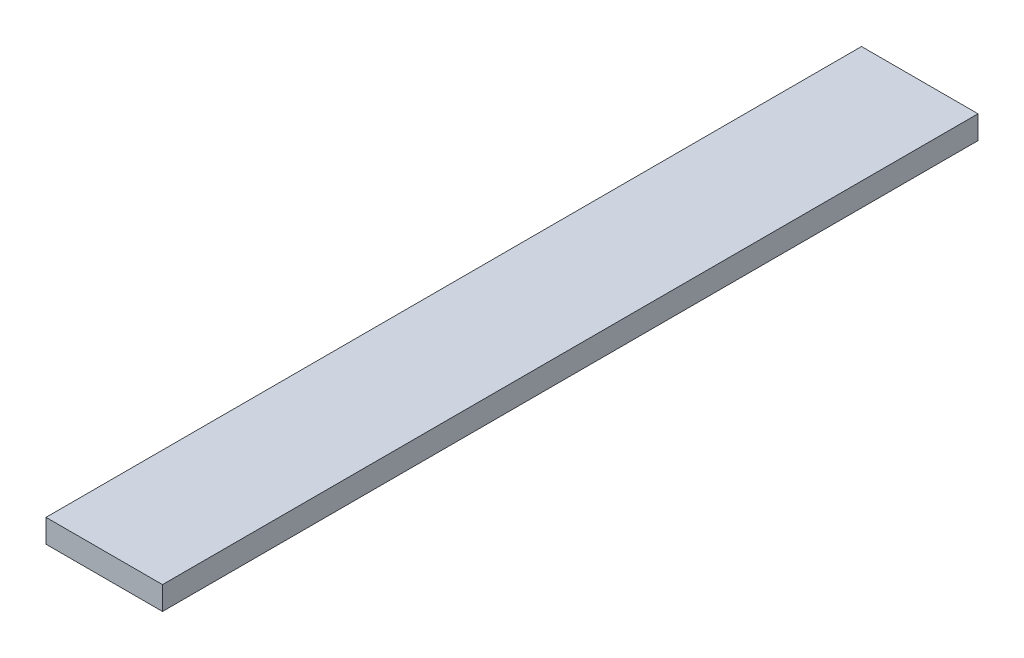
ISO-10303-21;
HEADER;
FILE_DESCRIPTION(('STEP AP214'),'2;1');
FILE_NAME('part.step','',(''),(''),'','','');
FILE_SCHEMA(('AUTOMOTIVE_DESIGN { 1 0 10303 214 1 1 1 1 }'));
ENDSEC;
DATA;
#1=APPLICATION_CONTEXT('core data for automotive mechanical design processes');
#2=APPLICATION_PROTOCOL_DEFINITION('international standard','automotive_design',2000,#1);
#3=PRODUCT_CONTEXT('',#1,'mechanical');
#4=PRODUCT('Part','Part','',(#3));
#5=PRODUCT_RELATED_PRODUCT_CATEGORY('part','',(#4));
#6=PRODUCT_DEFINITION_FORMATION('','',#4);
#7=PRODUCT_DEFINITION_CONTEXT('part definition',#1,'design');
#8=PRODUCT_DEFINITION('design','',#6,#7);
#9=PRODUCT_DEFINITION_SHAPE('','',#8);
#10=(LENGTH_UNIT() NAMED_UNIT(*) SI_UNIT(.MILLI.,.METRE.));
#11=(NAMED_UNIT(*) PLANE_ANGLE_UNIT() SI_UNIT($,.RADIAN.));
#12=(NAMED_UNIT(*) SI_UNIT($,.STERADIAN.) SOLID_ANGLE_UNIT());
#13=UNCERTAINTY_MEASURE_WITH_UNIT(LENGTH_MEASURE(1.E-05),#10,'distance_accuracy_value','');
#14=(GEOMETRIC_REPRESENTATION_CONTEXT(3) GLOBAL_UNCERTAINTY_ASSIGNED_CONTEXT((#13)) GLOBAL_UNIT_ASSIGNED_CONTEXT((#10,
#11,#12)) REPRESENTATION_CONTEXT('',''));
#15=CARTESIAN_POINT('',(0.,0.,0.));
#16=DIRECTION('',(0.,0.,1.));
#17=DIRECTION('',(1.,0.,0.));
#18=AXIS2_PLACEMENT_3D('',#15,#16,#17);
#19=CARTESIAN_POINT('',(-23.3544303797468,47.99,-47.8481012658228));
#20=DIRECTION('',(-1.,0.,0.));
#21=DIRECTION('',(0.,0.,1.));
#22=AXIS2_PLACEMENT_3D('',#19,#20,#21);
#23=PLANE('',#22);
#24=DIRECTION('',(0.,1.,0.));
#25=VECTOR('',#24,1.);
#26=CARTESIAN_POINT('',(-23.3544303797468,47.99,-47.8481012658228));
#27=LINE('',#26,#25);
#28=CARTESIAN_POINT('',(-23.3544303797468,48.,-47.8481012658228));
#29=VERTEX_POINT('',#28);
#30=CARTESIAN_POINT('',(-23.3544303797468,50.,-47.8481012658228));
#31=VERTEX_POINT('',#30);
#32=EDGE_CURVE('E36',#29,#31,#27,.T.);
#33=ORIENTED_EDGE('',*,*,#32,.F.);
#34=DIRECTION('',(0.,0.,1.));
#35=VECTOR('',#34,1.);
#36=CARTESIAN_POINT('',(-23.3544303797468,48.,0.));
#37=LINE('',#36,#35);
#38=CARTESIAN_POINT('',(-23.3544303797468,48.,22.1518987341772));
#39=VERTEX_POINT('',#38);
#40=EDGE_CURVE('E77',#29,#39,#37,.T.);
#41=ORIENTED_EDGE('',*,*,#40,.T.);
#42=DIRECTION('',(0.,1.,0.));
#43=VECTOR('',#42,1.);
#44=CARTESIAN_POINT('',(-23.3544303797468,47.99,22.1518987341772));
#45=LINE('',#44,#43);
#46=CARTESIAN_POINT('',(-23.3544303797468,50.,22.1518987341772));
#47=VERTEX_POINT('',#46);
#48=EDGE_CURVE('E87',#39,#47,#45,.T.);
#49=ORIENTED_EDGE('',*,*,#48,.T.);
#50=DIRECTION('',(0.,0.,1.));
#51=VECTOR('',#50,1.);
#52=CARTESIAN_POINT('',(-23.3544303797468,50.,0.));
#53=LINE('',#52,#51);
#54=EDGE_CURVE('E98',#31,#47,#53,.T.);
#55=ORIENTED_EDGE('',*,*,#54,.F.);
#56=EDGE_LOOP('',(#33,#41,#49,#55));
#57=FACE_BOUND('',#56,.T.);
#58=ADVANCED_FACE('F32',(#57),#23,.T.);
#59=CARTESIAN_POINT('',(-13.3544303797468,47.99,-47.8481012658228));
#60=DIRECTION('',(1.,0.,0.));
#61=DIRECTION('',(0.,0.,-1.));
#62=AXIS2_PLACEMENT_3D('',#59,#60,#61);
#63=PLANE('',#62);
#64=DIRECTION('',(0.,-1.,0.));
#65=VECTOR('',#64,1.);
#66=CARTESIAN_POINT('',(-13.3544303797468,50.,22.1518987341772));
#67=LINE('',#66,#65);
#68=CARTESIAN_POINT('',(-13.3544303797468,50.,22.1518987341772));
#69=VERTEX_POINT('',#68);
#70=CARTESIAN_POINT('',(-13.3544303797468,48.,22.1518987341772));
#71=VERTEX_POINT('',#70);
#72=EDGE_CURVE('E86',#69,#71,#67,.T.);
#73=ORIENTED_EDGE('',*,*,#72,.T.);
#74=DIRECTION('',(0.,0.,-1.));
#75=VECTOR('',#74,1.);
#76=CARTESIAN_POINT('',(-13.3544303797468,48.,0.));
#77=LINE('',#76,#75);
#78=CARTESIAN_POINT('',(-13.3544303797468,48.,-47.8481012658228));
#79=VERTEX_POINT('',#78);
#80=EDGE_CURVE('E75',#71,#79,#77,.T.);
#81=ORIENTED_EDGE('',*,*,#80,.T.);
#82=DIRECTION('',(0.,1.,0.));
#83=VECTOR('',#82,1.);
#84=CARTESIAN_POINT('',(-13.3544303797468,47.99,-47.8481012658228));
#85=LINE('',#84,#83);
#86=CARTESIAN_POINT('',(-13.3544303797468,50.,-47.8481012658228));
#87=VERTEX_POINT('',#86);
#88=EDGE_CURVE('E84',#79,#87,#85,.T.);
#89=ORIENTED_EDGE('',*,*,#88,.T.);
#90=DIRECTION('',(0.,0.,-1.));
#91=VECTOR('',#90,1.);
#92=CARTESIAN_POINT('',(-13.3544303797468,50.,0.));
#93=LINE('',#92,#91);
#94=EDGE_CURVE('E99',#69,#87,#93,.T.);
#95=ORIENTED_EDGE('',*,*,#94,.F.);
#96=EDGE_LOOP('',(#73,#81,#89,#95));
#97=FACE_BOUND('',#96,.T.);
#98=ADVANCED_FACE('F83',(#97),#63,.T.);
#99=CARTESIAN_POINT('',(-98.3544303797468,50.,-47.8481012658228));
#100=DIRECTION('',(0.,0.,1.));
#101=DIRECTION('',(1.,0.,0.));
#102=AXIS2_PLACEMENT_3D('',#99,#100,#101);
#103=PLANE('',#102);
#104=DIRECTION('',(-1.,0.,0.));
#105=VECTOR('',#104,1.);
#106=CARTESIAN_POINT('',(-98.3544303797468,48.,-47.8481012658228));
#107=LINE('',#106,#105);
#108=EDGE_CURVE('E72',#79,#29,#107,.T.);
#109=ORIENTED_EDGE('',*,*,#108,.T.);
#110=ORIENTED_EDGE('',*,*,#32,.T.);
#111=DIRECTION('',(-1.,0.,0.));
#112=VECTOR('',#111,1.);
#113=CARTESIAN_POINT('',(-98.3544303797468,50.,-47.8481012658228));
#114=LINE('',#113,#112);
#115=EDGE_CURVE('E41',#87,#31,#114,.T.);
#116=ORIENTED_EDGE('',*,*,#115,.F.);
#117=ORIENTED_EDGE('',*,*,#88,.F.);
#118=EDGE_LOOP('',(#109,#110,#116,#117));
#119=FACE_BOUND('',#118,.T.);
#120=ADVANCED_FACE('F34',(#119),#103,.F.);
#121=CARTESIAN_POINT('',(0.,50.,0.));
#122=DIRECTION('',(0.,1.,0.));
#123=DIRECTION('',(0.,0.,1.));
#124=AXIS2_PLACEMENT_3D('',#121,#122,#123);
#125=PLANE('',#124);
#126=ORIENTED_EDGE('',*,*,#115,.T.);
#127=ORIENTED_EDGE('',*,*,#54,.T.);
#128=DIRECTION('',(1.,0.,0.));
#129=VECTOR('',#128,1.);
#130=CARTESIAN_POINT('',(-98.3544303797468,50.,22.1518987341772));
#131=LINE('',#130,#129);
#132=EDGE_CURVE('E11',#47,#69,#131,.T.);
#133=ORIENTED_EDGE('',*,*,#132,.T.);
#134=ORIENTED_EDGE('',*,*,#94,.T.);
#135=EDGE_LOOP('',(#126,#127,#133,#134));
#136=FACE_BOUND('',#135,.T.);
#137=ADVANCED_FACE('F102',(#136),#125,.T.);
#138=CARTESIAN_POINT('',(0.,48.,0.));
#139=DIRECTION('',(0.,1.,0.));
#140=DIRECTION('',(0.,0.,1.));
#141=AXIS2_PLACEMENT_3D('',#138,#139,#140);
#142=PLANE('',#141);
#143=ORIENTED_EDGE('',*,*,#40,.F.);
#144=ORIENTED_EDGE('',*,*,#108,.F.);
#145=ORIENTED_EDGE('',*,*,#80,.F.);
#146=DIRECTION('',(1.,0.,0.));
#147=VECTOR('',#146,1.);
#148=CARTESIAN_POINT('',(-98.3544303797468,48.,22.1518987341772));
#149=LINE('',#148,#147);
#150=EDGE_CURVE('E79',#39,#71,#149,.T.);
#151=ORIENTED_EDGE('',*,*,#150,.F.);
#152=EDGE_LOOP('',(#143,#144,#145,#151));
#153=FACE_BOUND('',#152,.T.);
#154=ADVANCED_FACE('F74',(#153),#142,.F.);
#155=CARTESIAN_POINT('',(-98.3544303797468,50.,22.1518987341772));
#156=DIRECTION('',(0.,0.,-1.));
#157=DIRECTION('',(-1.,0.,0.));
#158=AXIS2_PLACEMENT_3D('',#155,#156,#157);
#159=PLANE('',#158);
#160=ORIENTED_EDGE('',*,*,#48,.F.);
#161=ORIENTED_EDGE('',*,*,#150,.T.);
#162=ORIENTED_EDGE('',*,*,#72,.F.);
#163=ORIENTED_EDGE('',*,*,#132,.F.);
#164=EDGE_LOOP('',(#160,#161,#162,#163));
#165=FACE_BOUND('',#164,.T.);
#166=ADVANCED_FACE('F106',(#165),#159,.F.);
#167=CLOSED_SHELL('',(#58,#98,#120,#137,#154,#166));
#168=MANIFOLD_SOLID_BREP('B2',#167);
#169=ADVANCED_BREP_SHAPE_REPRESENTATION('',(#18,#168),#14);
#170=SHAPE_DEFINITION_REPRESENTATION(#9,#169);
ENDSEC;
END-ISO-10303-21;
